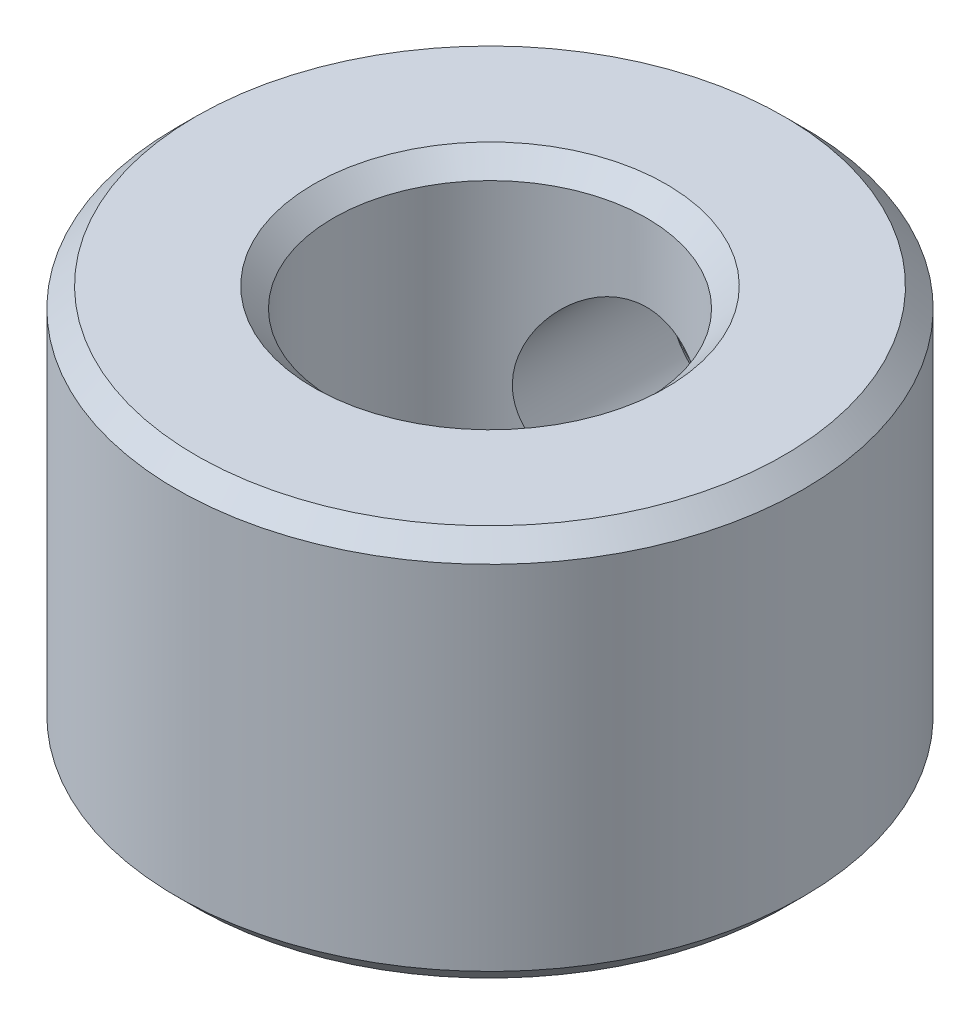
ISO-10303-21;
HEADER;
FILE_DESCRIPTION(('STEP AP214'),'2;1');
FILE_NAME('part.step','',(''),(''),'','','');
FILE_SCHEMA(('AUTOMOTIVE_DESIGN { 1 0 10303 214 1 1 1 1 }'));
ENDSEC;
DATA;
#1=APPLICATION_CONTEXT('core data for automotive mechanical design processes');
#2=APPLICATION_PROTOCOL_DEFINITION('international standard','automotive_design',2000,#1);
#3=PRODUCT_CONTEXT('',#1,'mechanical');
#4=PRODUCT('Part','Part','',(#3));
#5=PRODUCT_RELATED_PRODUCT_CATEGORY('part','',(#4));
#6=PRODUCT_DEFINITION_FORMATION('','',#4);
#7=PRODUCT_DEFINITION_CONTEXT('part definition',#1,'design');
#8=PRODUCT_DEFINITION('design','',#6,#7);
#9=PRODUCT_DEFINITION_SHAPE('','',#8);
#10=(LENGTH_UNIT() NAMED_UNIT(*) SI_UNIT(.MILLI.,.METRE.));
#11=(NAMED_UNIT(*) PLANE_ANGLE_UNIT() SI_UNIT($,.RADIAN.));
#12=(NAMED_UNIT(*) SI_UNIT($,.STERADIAN.) SOLID_ANGLE_UNIT());
#13=UNCERTAINTY_MEASURE_WITH_UNIT(LENGTH_MEASURE(1.E-05),#10,'distance_accuracy_value','');
#14=(GEOMETRIC_REPRESENTATION_CONTEXT(3) GLOBAL_UNCERTAINTY_ASSIGNED_CONTEXT((#13)) GLOBAL_UNIT_ASSIGNED_CONTEXT((#10,
#11,#12)) REPRESENTATION_CONTEXT('',''));
#15=CARTESIAN_POINT('',(0.,0.,0.));
#16=DIRECTION('',(0.,0.,1.));
#17=DIRECTION('',(1.,0.,0.));
#18=AXIS2_PLACEMENT_3D('',#15,#16,#17);
#19=CARTESIAN_POINT('',(0.,4.875,0.));
#20=DIRECTION('',(0.,1.,0.));
#21=DIRECTION('',(1.,0.,0.));
#22=AXIS2_PLACEMENT_3D('',#19,#20,#21);
#23=CONICAL_SURFACE('',#22,2.125,0.785398163397448);
#24=CARTESIAN_POINT('',(0.,5.,0.));
#25=DIRECTION('',(0.,1.,0.));
#26=DIRECTION('',(1.,0.,0.));
#27=AXIS2_PLACEMENT_3D('',#24,#25,#26);
#28=CIRCLE('',#27,2.25);
#29=CARTESIAN_POINT('',(-2.25,5.,0.));
#30=VERTEX_POINT('',#29);
#31=EDGE_CURVE('E177',#30,#30,#28,.T.);
#32=ORIENTED_EDGE('',*,*,#31,.T.);
#33=DIRECTION('',(0.707106781186547,-0.707106781186548,0.));
#34=VECTOR('',#33,1.);
#35=CARTESIAN_POINT('',(-2.125,4.875,0.));
#36=LINE('',#35,#34);
#37=CARTESIAN_POINT('',(-2.,4.75,0.));
#38=VERTEX_POINT('',#37);
#39=EDGE_CURVE('E11',#30,#38,#36,.T.);
#40=ORIENTED_EDGE('',*,*,#39,.T.);
#41=CARTESIAN_POINT('',(0.,4.75,0.));
#42=DIRECTION('',(0.,-1.,0.));
#43=DIRECTION('',(1.,0.,0.));
#44=AXIS2_PLACEMENT_3D('',#41,#42,#43);
#45=CIRCLE('',#44,2.);
#46=EDGE_CURVE('E198',#38,#38,#45,.T.);
#47=ORIENTED_EDGE('',*,*,#46,.T.);
#48=ORIENTED_EDGE('',*,*,#39,.F.);
#49=EDGE_LOOP('',(#32,#40,#47,#48));
#50=FACE_BOUND('',#49,.T.);
#51=ADVANCED_FACE('F17',(#50),#23,.F.);
#52=CARTESIAN_POINT('',(0.,0.,0.));
#53=DIRECTION('',(0.,1.,0.));
#54=DIRECTION('',(1.,0.,0.));
#55=AXIS2_PLACEMENT_3D('',#52,#53,#54);
#56=CYLINDRICAL_SURFACE('',#55,2.);
#57=CARTESIAN_POINT('',(1.2645,2.5,-1.54952888001483));
#58=CARTESIAN_POINT('',(1.26449411796691,2.43735012324644,-1.54953832528692));
#59=CARTESIAN_POINT('',(1.25980123596175,2.37460998732213,-1.55340009895582));
#60=CARTESIAN_POINT('',(1.24137298283824,2.25126618343794,-1.56815840057098));
#61=CARTESIAN_POINT('',(1.22761427551083,2.19066845550868,-1.57907308189968));
#62=CARTESIAN_POINT('',(1.19205271815077,2.07376857766439,-1.60608182446035));
#63=CARTESIAN_POINT('',(1.17032101939601,2.01743359363941,-1.62212991738661));
#64=CARTESIAN_POINT('',(1.11963684574248,1.90928453446939,-1.65751838322308));
#65=CARTESIAN_POINT('',(1.09068388775742,1.85747076209657,-1.67685897636678));
#66=CARTESIAN_POINT('',(1.02173617894958,1.75199397208212,-1.71986123397177));
#67=CARTESIAN_POINT('',(0.980769943374188,1.69905883131843,-1.7437511823403));
#68=CARTESIAN_POINT('',(0.89093919554735,1.6001925381209,-1.79131669705349));
#69=CARTESIAN_POINT('',(0.842067766194926,1.55426758868601,-1.81499205629592));
#70=CARTESIAN_POINT('',(0.730451803901077,1.465052650476,-1.86294646109463));
#71=CARTESIAN_POINT('',(0.666737528883957,1.42280305888443,-1.88693350492434));
#72=CARTESIAN_POINT('',(0.531298337879028,1.34996747456659,-1.92944044111025));
#73=CARTESIAN_POINT('',(0.459581610447951,1.31936969802778,-1.9479658526651));
#74=CARTESIAN_POINT('',(0.318000809823785,1.27412401821854,-1.97573486186531));
#75=CARTESIAN_POINT('',(0.248713007533473,1.25815324205258,-1.98574058327142));
#76=CARTESIAN_POINT('',(0.107801673786748,1.23810190006417,-1.99833990319646));
#77=CARTESIAN_POINT('',(0.0361807627911929,1.23400843009899,-2.00094154584486));
#78=CARTESIAN_POINT('',(-0.0967328525311562,1.23769823411709,-1.99861152687371));
#79=CARTESIAN_POINT('',(-0.158094030613458,1.24392864060202,-1.99466473631825));
#80=CARTESIAN_POINT('',(-0.278694570481386,1.26507623336505,-1.98141571029734));
#81=CARTESIAN_POINT('',(-0.337933771771026,1.27999407525198,-1.97211307064624));
#82=CARTESIAN_POINT('',(-0.452914762909885,1.31784031499373,-1.9489274314289));
#83=CARTESIAN_POINT('',(-0.508651031986307,1.34078100131795,-1.9350374072614));
#84=CARTESIAN_POINT('',(-0.615518921331753,1.39380889945209,-1.90374389911779));
#85=CARTESIAN_POINT('',(-0.66664952948229,1.42389767683448,-1.88633964558184));
#86=CARTESIAN_POINT('',(-0.769757581284988,1.49460510074034,-1.84685964638113));
#87=CARTESIAN_POINT('',(-0.821032566750792,1.53607218519547,-1.82447166495386));
#88=CARTESIAN_POINT('',(-0.916345547494313,1.62616876997324,-1.77851561123726));
#89=CARTESIAN_POINT('',(-0.960372651636247,1.67480884469536,-1.75494583119227));
#90=CARTESIAN_POINT('',(-1.04598643244538,1.78556668533021,-1.70548199944205));
#91=CARTESIAN_POINT('',(-1.08644277160218,1.84861743719009,-1.67970330352267));
#92=CARTESIAN_POINT('',(-1.15604990573414,1.98216587136297,-1.63258088815751));
#93=CARTESIAN_POINT('',(-1.1852213789095,2.05264962893361,-1.61122909058669));
#94=CARTESIAN_POINT('',(-1.2246161450688,2.17992201583035,-1.58137778507439));
#95=CARTESIAN_POINT('',(-1.23781972955308,2.23533731102721,-1.57096854929203));
#96=CARTESIAN_POINT('',(-1.2566505024441,2.34817824878922,-1.55594978135884));
#97=CARTESIAN_POINT('',(-1.26228851443341,2.40560089853876,-1.55133196441425));
#98=CARTESIAN_POINT('',(-1.26564578829317,2.52098806068944,-1.54859515876369));
#99=CARTESIAN_POINT('',(-1.26334448419211,2.57895359188928,-1.55049304825479));
#100=CARTESIAN_POINT('',(-1.25093577610471,2.69350884817042,-1.56051880729487));
#101=CARTESIAN_POINT('',(-1.24082186157763,2.75009738516122,-1.56865187280686));
#102=CARTESIAN_POINT('',(-1.21366943674918,2.85925861904806,-1.58974532293077));
#103=CARTESIAN_POINT('',(-1.1967843787254,2.91189147657731,-1.60259823220519));
#104=CARTESIAN_POINT('',(-1.15675412768388,3.01368807254575,-1.63172650488258));
#105=CARTESIAN_POINT('',(-1.1336067386191,3.06285058637963,-1.64800306843138));
#106=CARTESIAN_POINT('',(-1.07658218628269,3.16638258759106,-1.68592855061878));
#107=CARTESIAN_POINT('',(-1.04149675234294,3.21992850889003,-1.70800822887954));
#108=CARTESIAN_POINT('',(-0.963864401793085,3.32096981729384,-1.75299258821368));
#109=CARTESIAN_POINT('',(-0.921309629627182,3.36845874251176,-1.77589811748598));
#110=CARTESIAN_POINT('',(-0.821420704703212,3.46425733392833,-1.82451368153187));
#111=CARTESIAN_POINT('',(-0.762803985042327,3.51133859050659,-1.8500399732252));
#112=CARTESIAN_POINT('',(-0.636990044557513,3.59494194218451,-1.8970357779525));
#113=CARTESIAN_POINT('',(-0.569796236109793,3.6314682178001,-1.91850689595041));
#114=CARTESIAN_POINT('',(-0.432254308912909,3.69054688083504,-1.95394855830421));
#115=CARTESIAN_POINT('',(-0.362282006019539,3.7137564589949,-1.96826622926783));
#116=CARTESIAN_POINT('',(-0.218314556068939,3.74769609803434,-1.98937292908515));
#117=CARTESIAN_POINT('',(-0.144325456886686,3.75844440401708,-1.99617296416441));
#118=CARTESIAN_POINT('',(-0.00665707801373274,3.76606929450586,-2.00099185098277));
#119=CARTESIAN_POINT('',(0.0568858046173655,3.76480085080471,-2.0001850416096));
#120=CARTESIAN_POINT('',(0.182709540069951,3.75282403612561,-1.99263276935113));
#121=CARTESIAN_POINT('',(0.244990477096484,3.74211629713365,-1.98588770404796));
#122=CARTESIAN_POINT('',(0.364008255181647,3.712464633797,-1.96748125913666));
#123=CARTESIAN_POINT('',(0.420867567149991,3.6938735435709,-1.95603107711261));
#124=CARTESIAN_POINT('',(0.530593796569564,3.64932134254513,-1.92916148883134));
#125=CARTESIAN_POINT('',(0.58346008343398,3.62335907074123,-1.91374145733531));
#126=CARTESIAN_POINT('',(0.68954176175382,3.56189672046674,-1.8782890840866));
#127=CARTESIAN_POINT('',(0.742245311387839,3.52569494478695,-1.85794707932388));
#128=CARTESIAN_POINT('',(0.841195569530736,3.44624724224734,-1.81529603663499));
#129=CARTESIAN_POINT('',(0.887435048339554,3.40299354345176,-1.79298484104648));
#130=CARTESIAN_POINT('',(0.979270491623404,3.3032714453577,-1.7447348464483));
#131=CARTESIAN_POINT('',(1.02375166101236,3.24579451602162,-1.71874926626124));
#132=CARTESIAN_POINT('',(1.10261752614741,3.12329097722003,-1.66925222113531));
#133=CARTESIAN_POINT('',(1.1370067814702,3.05826779577634,-1.64573964197263));
#134=CARTESIAN_POINT('',(1.18818249135166,2.93651580305712,-1.60903404622307));
#135=CARTESIAN_POINT('',(1.20717019521899,2.88105495048418,-1.59470883609959));
#136=CARTESIAN_POINT('',(1.23737203476855,2.76706109813201,-1.57139495785571));
#137=CARTESIAN_POINT('',(1.24861010049216,2.70853816143648,-1.56238987421431));
#138=CARTESIAN_POINT('',(1.25859624043419,2.62456942414068,-1.55433160058593));
#139=CARTESIAN_POINT('',(1.26080597808091,2.59974838666082,-1.55253745914827));
#140=CARTESIAN_POINT('',(1.26375922886068,2.54995637712227,-1.5501340553494));
#141=CARTESIAN_POINT('',(1.26450234581071,2.52498536637754,-1.54952511315053));
#142=CARTESIAN_POINT('',(1.2645,2.5,-1.54952888001483));
#143=B_SPLINE_CURVE_WITH_KNOTS('',3,(#57,#58,#59,#60,#61,#62,#63,#64,#65,#66,#67,#68,#69,#70,
#71,#72,#73,#74,#75,#76,#77,#78,#79,#80,#81,#82,#83,#84,#85,#86,#87,#88,#89,#90,#91,#92,#93,#94,
#95,#96,#97,#98,#99,#100,#101,#102,#103,#104,#105,#106,#107,#108,#109,#110,#111,#112,#113,#114,
#115,#116,#117,#118,#119,#120,#121,#122,#123,#124,#125,#126,#127,#128,#129,#130,#131,#132,#133,
#134,#135,#136,#137,#138,#139,#140,#141,#142),.UNSPECIFIED.,.T.,.F.,(4,2,2,2,2,2,2,2,2,2,2,2,2,
2,2,2,2,2,2,2,2,2,2,2,2,2,2,2,2,2,2,2,2,2,2,2,2,2,2,2,2,2,4),(0.,0.187834998618613,
0.376155399361165,0.562834551812605,0.74952619603823,0.96192621140118,1.17451309377345,
1.41357454197133,1.65239357434149,1.86649900785851,2.08037173848349,2.26489251750059,
2.44942722342765,2.63424582532583,2.81910494351061,3.02721650045857,3.23563797985774,
3.47217432561049,3.70827516954924,3.88128567913113,4.05404840877014,4.2272589979291,
4.40061408588117,4.57024443479238,4.73993434621561,4.94234058954809,5.14496099459186,
5.38196739397222,5.618879793056,5.84278297062728,6.06635790592645,6.25605905235322,
6.44574749874689,6.62771803900912,6.80971725661148,7.01023551077349,7.21097626913794,
7.44152072744398,7.67196086369056,7.85232662520503,8.03213291238308,8.10702306777426,
8.18193345071839),.UNSPECIFIED.);
#144=CARTESIAN_POINT('',(-1.2645,2.5,-1.54952888001483));
#145=VERTEX_POINT('',#144);
#146=EDGE_CURVE('E94',#145,#145,#143,.T.);
#147=ORIENTED_EDGE('',*,*,#146,.T.);
#148=EDGE_LOOP('',(#147));
#149=FACE_BOUND('',#148,.T.);
#150=ORIENTED_EDGE('',*,*,#46,.F.);
#151=DIRECTION('',(0.,-1.,0.));
#152=VECTOR('',#151,1.);
#153=CARTESIAN_POINT('',(-2.,0.,0.));
#154=LINE('',#153,#152);
#155=CARTESIAN_POINT('',(-2.,0.25,0.));
#156=VERTEX_POINT('',#155);
#157=EDGE_CURVE('E26',#38,#156,#154,.T.);
#158=ORIENTED_EDGE('',*,*,#157,.T.);
#159=CARTESIAN_POINT('',(0.,0.25,0.));
#160=DIRECTION('',(0.,1.,0.));
#161=DIRECTION('',(1.,0.,0.));
#162=AXIS2_PLACEMENT_3D('',#159,#160,#161);
#163=CIRCLE('',#162,2.);
#164=EDGE_CURVE('E180',#156,#156,#163,.T.);
#165=ORIENTED_EDGE('',*,*,#164,.F.);
#166=ORIENTED_EDGE('',*,*,#157,.F.);
#167=EDGE_LOOP('',(#150,#158,#165,#166));
#168=FACE_BOUND('',#167,.T.);
#169=ADVANCED_FACE('F162',(#149,#168),#56,.F.);
#170=CARTESIAN_POINT('',(0.,0.125,0.));
#171=DIRECTION('',(0.,-1.,0.));
#172=DIRECTION('',(1.,0.,0.));
#173=AXIS2_PLACEMENT_3D('',#170,#171,#172);
#174=CONICAL_SURFACE('',#173,2.125,0.785398163397448);
#175=ORIENTED_EDGE('',*,*,#164,.T.);
#176=DIRECTION('',(-0.707106781186547,-0.707106781186548,0.));
#177=VECTOR('',#176,1.);
#178=CARTESIAN_POINT('',(-2.125,0.125,0.));
#179=LINE('',#178,#177);
#180=CARTESIAN_POINT('',(-2.25,0.,0.));
#181=VERTEX_POINT('',#180);
#182=EDGE_CURVE('E188',#156,#181,#179,.T.);
#183=ORIENTED_EDGE('',*,*,#182,.T.);
#184=CARTESIAN_POINT('',(0.,0.,0.));
#185=DIRECTION('',(0.,-1.,0.));
#186=DIRECTION('',(1.,0.,0.));
#187=AXIS2_PLACEMENT_3D('',#184,#185,#186);
#188=CIRCLE('',#187,2.25);
#189=EDGE_CURVE('E235',#181,#181,#188,.T.);
#190=ORIENTED_EDGE('',*,*,#189,.T.);
#191=ORIENTED_EDGE('',*,*,#182,.F.);
#192=EDGE_LOOP('',(#175,#183,#190,#191));
#193=FACE_BOUND('',#192,.T.);
#194=ADVANCED_FACE('F175',(#193),#174,.F.);
#195=CARTESIAN_POINT('',(0.,5.,0.));
#196=DIRECTION('',(0.,1.,0.));
#197=DIRECTION('',(1.,0.,0.));
#198=AXIS2_PLACEMENT_3D('',#195,#196,#197);
#199=PLANE('',#198);
#200=ORIENTED_EDGE('',*,*,#31,.F.);
#201=EDGE_LOOP('',(#200));
#202=FACE_BOUND('',#201,.T.);
#203=CARTESIAN_POINT('',(0.,5.,0.));
#204=DIRECTION('',(0.,-1.,0.));
#205=DIRECTION('',(1.,0.,0.));
#206=AXIS2_PLACEMENT_3D('',#203,#204,#205);
#207=CIRCLE('',#206,3.75);
#208=CARTESIAN_POINT('',(-3.75,5.,0.));
#209=VERTEX_POINT('',#208);
#210=EDGE_CURVE('E190',#209,#209,#207,.T.);
#211=ORIENTED_EDGE('',*,*,#210,.F.);
#212=EDGE_LOOP('',(#211));
#213=FACE_BOUND('',#212,.T.);
#214=ADVANCED_FACE('F295',(#202,#213),#199,.T.);
#215=CARTESIAN_POINT('',(0.,4.875,0.));
#216=DIRECTION('',(0.,-1.,0.));
#217=DIRECTION('',(1.,0.,0.));
#218=AXIS2_PLACEMENT_3D('',#215,#216,#217);
#219=CONICAL_SURFACE('',#218,3.875,0.785398163397448);
#220=ORIENTED_EDGE('',*,*,#210,.T.);
#221=DIRECTION('',(-0.707106781186548,-0.707106781186548,0.));
#222=VECTOR('',#221,1.);
#223=CARTESIAN_POINT('',(-3.875,4.875,0.));
#224=LINE('',#223,#222);
#225=CARTESIAN_POINT('',(-4.,4.75,0.));
#226=VERTEX_POINT('',#225);
#227=EDGE_CURVE('E181',#209,#226,#224,.T.);
#228=ORIENTED_EDGE('',*,*,#227,.T.);
#229=CARTESIAN_POINT('',(0.,4.75,0.));
#230=DIRECTION('',(0.,1.,0.));
#231=DIRECTION('',(1.,0.,0.));
#232=AXIS2_PLACEMENT_3D('',#229,#230,#231);
#233=CIRCLE('',#232,4.);
#234=EDGE_CURVE('E148',#226,#226,#233,.T.);
#235=ORIENTED_EDGE('',*,*,#234,.T.);
#236=ORIENTED_EDGE('',*,*,#227,.F.);
#237=EDGE_LOOP('',(#220,#228,#235,#236));
#238=FACE_BOUND('',#237,.T.);
#239=ADVANCED_FACE('F292',(#238),#219,.T.);
#240=CARTESIAN_POINT('',(0.,0.,0.));
#241=DIRECTION('',(0.,1.,0.));
#242=DIRECTION('',(1.,0.,0.));
#243=AXIS2_PLACEMENT_3D('',#240,#241,#242);
#244=PLANE('',#243);
#245=ORIENTED_EDGE('',*,*,#189,.F.);
#246=EDGE_LOOP('',(#245));
#247=FACE_BOUND('',#246,.T.);
#248=CARTESIAN_POINT('',(0.,0.,0.));
#249=DIRECTION('',(0.,1.,0.));
#250=DIRECTION('',(1.,0.,0.));
#251=AXIS2_PLACEMENT_3D('',#248,#249,#250);
#252=CIRCLE('',#251,3.75);
#253=CARTESIAN_POINT('',(-3.75,0.,0.));
#254=VERTEX_POINT('',#253);
#255=EDGE_CURVE('E230',#254,#254,#252,.T.);
#256=ORIENTED_EDGE('',*,*,#255,.F.);
#257=EDGE_LOOP('',(#256));
#258=FACE_BOUND('',#257,.T.);
#259=ADVANCED_FACE('F287',(#247,#258),#244,.F.);
#260=CARTESIAN_POINT('',(0.,0.125,0.));
#261=DIRECTION('',(0.,1.,0.));
#262=DIRECTION('',(1.,0.,0.));
#263=AXIS2_PLACEMENT_3D('',#260,#261,#262);
#264=CONICAL_SURFACE('',#263,3.875,0.785398163397449);
#265=CARTESIAN_POINT('',(0.,0.25,0.));
#266=DIRECTION('',(0.,-1.,0.));
#267=DIRECTION('',(1.,0.,0.));
#268=AXIS2_PLACEMENT_3D('',#265,#266,#267);
#269=CIRCLE('',#268,4.);
#270=CARTESIAN_POINT('',(-4.,0.25,0.));
#271=VERTEX_POINT('',#270);
#272=EDGE_CURVE('E231',#271,#271,#269,.T.);
#273=ORIENTED_EDGE('',*,*,#272,.T.);
#274=DIRECTION('',(0.707106781186548,-0.707106781186547,0.));
#275=VECTOR('',#274,1.);
#276=CARTESIAN_POINT('',(-3.875,0.125,0.));
#277=LINE('',#276,#275);
#278=EDGE_CURVE('E193',#271,#254,#277,.T.);
#279=ORIENTED_EDGE('',*,*,#278,.T.);
#280=ORIENTED_EDGE('',*,*,#255,.T.);
#281=ORIENTED_EDGE('',*,*,#278,.F.);
#282=EDGE_LOOP('',(#273,#279,#280,#281));
#283=FACE_BOUND('',#282,.T.);
#284=ADVANCED_FACE('F169',(#283),#264,.T.);
#285=CARTESIAN_POINT('',(0.,0.,0.));
#286=DIRECTION('',(0.,1.,0.));
#287=DIRECTION('',(1.,0.,0.));
#288=AXIS2_PLACEMENT_3D('',#285,#286,#287);
#289=CYLINDRICAL_SURFACE('',#288,4.);
#290=CARTESIAN_POINT('',(-1.49909382170273,2.5,-3.70846568188599));
#291=CARTESIAN_POINT('',(-1.49909382170273,2.72089732128893,-3.70846568188599));
#292=CARTESIAN_POINT('',(-1.38922205118641,3.19635642810341,-3.75235090255221));
#293=CARTESIAN_POINT('',(-0.83670897618908,3.89780784607125,-3.94334263837228));
#294=CARTESIAN_POINT('',(0.134475216136004,4.14246029251629,-4.05059755334012));
#295=CARTESIAN_POINT('',(0.877762587617222,3.76473716202204,-3.90863752858632));
#296=CARTESIAN_POINT('',(1.17855956450457,3.46068884661615,-3.82497921274844));
#297=CARTESIAN_POINT('',(1.42325993677328,3.06780020018476,-3.74155425360215));
#298=CARTESIAN_POINT('',(1.54874891459138,2.5047164954535,-3.68554379966131));
#299=CARTESIAN_POINT('',(1.34579703618987,1.58050804657097,-3.77692919929063));
#300=CARTESIAN_POINT('',(0.58671246259579,0.976733181262446,-4.00522023908345));
#301=CARTESIAN_POINT('',(-0.344933753518193,0.971338670866824,-4.00467209967727));
#302=CARTESIAN_POINT('',(-0.980947661805724,1.28301447876608,-3.8915658372877));
#303=CARTESIAN_POINT('',(-1.38467666273256,1.80064474179365,-3.75513782088051));
#304=CARTESIAN_POINT('',(-1.49909382170273,2.27910267871108,-3.70846568188599));
#305=CARTESIAN_POINT('',(-1.49909382170273,2.5,-3.70846568188599));
#306=(BOUNDED_CURVE() B_SPLINE_CURVE(3,(#290,#291,#292,#293,#294,#295,#296,#297,#298,#299,#300,
#301,#302,#303,#304,#305),.UNSPECIFIED.,.T.,.F.) B_SPLINE_CURVE_WITH_KNOTS((4,1,1,1,1,1,1,1,1,1,
1,1,1,4),(0.,0.0548453600584061,0.109690720116813,0.219381440233627,0.274226800292034,
0.301649480321237,0.329072160350441,0.383917520408847,0.438762880467254,0.548453600584068,
0.603298960642475,0.658144320700881,0.712989680759288,0.767835040817695),
.UNSPECIFIED.) CURVE() GEOMETRIC_REPRESENTATION_ITEM() RATIONAL_B_SPLINE_CURVE((1.,1.,1.,1.,1.,
1.,1.,1.,1.,1.,1.,1.,1.,1.,1.,1.)) REPRESENTATION_ITEM(''));
#307=CARTESIAN_POINT('',(-1.49909382170353,2.5,-3.70846568188655));
#308=VERTEX_POINT('',#307);
#309=EDGE_CURVE('E86',#308,#308,#306,.T.);
#310=ORIENTED_EDGE('',*,*,#309,.F.);
#311=EDGE_LOOP('',(#310));
#312=FACE_BOUND('',#311,.T.);
#313=ORIENTED_EDGE('',*,*,#234,.F.);
#314=DIRECTION('',(0.,-1.,0.));
#315=VECTOR('',#314,1.);
#316=CARTESIAN_POINT('',(-4.,0.,0.));
#317=LINE('',#316,#315);
#318=EDGE_CURVE('E156',#226,#271,#317,.T.);
#319=ORIENTED_EDGE('',*,*,#318,.T.);
#320=ORIENTED_EDGE('',*,*,#272,.F.);
#321=ORIENTED_EDGE('',*,*,#318,.F.);
#322=EDGE_LOOP('',(#313,#319,#320,#321));
#323=FACE_BOUND('',#322,.T.);
#324=ADVANCED_FACE('F164',(#312,#323),#289,.T.);
#325=CARTESIAN_POINT('',(0.,2.5,0.));
#326=DIRECTION('',(0.,0.,-1.));
#327=DIRECTION('',(1.,0.,0.));
#328=AXIS2_PLACEMENT_3D('',#325,#326,#327);
#329=CYLINDRICAL_SURFACE('',#328,1.2645);
#330=ORIENTED_EDGE('',*,*,#146,.F.);
#331=DIRECTION('',(0.,0.,-1.));
#332=VECTOR('',#331,1.);
#333=CARTESIAN_POINT('',(-1.2645,2.5,0.));
#334=LINE('',#333,#332);
#335=CARTESIAN_POINT('',(-1.2645,2.5,-3.54487018882069));
#336=VERTEX_POINT('',#335);
#337=EDGE_CURVE('E141',#145,#336,#334,.T.);
#338=ORIENTED_EDGE('',*,*,#337,.T.);
#339=CARTESIAN_POINT('',(-1.2645,2.5,-3.54487018882069));
#340=CARTESIAN_POINT('',(-1.2645,2.30513838343412,-3.54487018882069));
#341=CARTESIAN_POINT('',(-1.15345052099916,1.88446936891256,-3.57970347471206));
#342=CARTESIAN_POINT('',(-0.786408014453958,1.45704909304605,-3.67834808926274));
#343=CARTESIAN_POINT('',(-0.265009806986551,1.2252731657563,-3.75286596992555));
#344=CARTESIAN_POINT('',(0.447537665195123,1.22598802030911,-3.75513969316828));
#345=CARTESIAN_POINT('',(1.11012956348669,1.68773755547493,-3.5972577942593));
#346=CARTESIAN_POINT('',(1.31564721330752,2.50481059416571,-3.52710582475938));
#347=CARTESIAN_POINT('',(1.18951754981533,3.00031332352077,-3.56982230561473));
#348=CARTESIAN_POINT('',(0.966644388217517,3.33074133040212,-3.62998545166653));
#349=CARTESIAN_POINT('',(0.700913744542567,3.57814661811471,-3.68941528329172));
#350=CARTESIAN_POINT('',(0.0977762955579307,3.85760231497487,-3.78324886983267));
#351=CARTESIAN_POINT('',(-0.650957008547244,3.68817240149751,-3.71447903576025));
#352=CARTESIAN_POINT('',(-1.15935930369818,3.11493574902256,-3.57827749934624));
#353=CARTESIAN_POINT('',(-1.2645,2.69486161656589,-3.54487018882069));
#354=CARTESIAN_POINT('',(-1.2645,2.5,-3.54487018882069));
#355=(BOUNDED_CURVE() B_SPLINE_CURVE(3,(#339,#340,#341,#342,#343,#344,#345,#346,#347,#348,#349,
#350,#351,#352,#353,#354),.UNSPECIFIED.,.T.,.F.) B_SPLINE_CURVE_WITH_KNOTS((4,1,1,1,1,1,1,1,1,1,
1,1,1,4),(0.,0.0548453600584068,0.109690720116814,0.16453608017522,0.219381440233627,
0.329072160350441,0.383917520408848,0.438762880467254,0.466185560496458,0.493608240525661,
0.548453600584068,0.658144320700882,0.712989680759289,0.767835040817695),
.UNSPECIFIED.) CURVE() GEOMETRIC_REPRESENTATION_ITEM() RATIONAL_B_SPLINE_CURVE((1.,1.,1.,1.,1.,
1.,1.,1.,1.,1.,1.,1.,1.,1.,1.,1.)) REPRESENTATION_ITEM(''));
#356=EDGE_CURVE('E95',#336,#336,#355,.T.);
#357=ORIENTED_EDGE('',*,*,#356,.F.);
#358=ORIENTED_EDGE('',*,*,#337,.F.);
#359=EDGE_LOOP('',(#330,#338,#357,#358));
#360=FACE_BOUND('',#359,.T.);
#361=ADVANCED_FACE('F116',(#360),#329,.F.);
#362=CARTESIAN_POINT('',(-1.49909382170353,2.5,-3.70846568188655));
#363=CARTESIAN_POINT('',(-1.49909382170353,2.27910267871099,-3.70846568188655));
#364=CARTESIAN_POINT('',(-1.38467666273335,1.80064474179336,-3.75513782088111));
#365=CARTESIAN_POINT('',(-0.980947661806387,1.28301447876549,-3.89156583728843));
#366=CARTESIAN_POINT('',(-0.344933753518465,0.971338670865958,-4.00467209967813));
#367=CARTESIAN_POINT('',(0.586712462596265,0.976733181261597,-4.0052202390843));
#368=CARTESIAN_POINT('',(1.34579703619067,1.5805080465706,-3.77692919929124));
#369=CARTESIAN_POINT('',(1.54874891459217,2.5047164954535,-3.68554379966185));
#370=CARTESIAN_POINT('',(1.42325993677408,3.06780020018499,-3.74155425360274));
#371=CARTESIAN_POINT('',(1.17855956450529,3.46068884661659,-3.8249792127491));
#372=CARTESIAN_POINT('',(0.877762587617825,3.76473716202268,-3.90863752858707));
#373=CARTESIAN_POINT('',(0.134475216136129,4.14246029251726,-4.05059755334103));
#374=CARTESIAN_POINT('',(-0.836708976189713,3.89780784607197,-3.94334263837306));
#375=CARTESIAN_POINT('',(-1.38922205118719,3.19635642810369,-3.7523509025528));
#376=CARTESIAN_POINT('',(-1.49909382170353,2.72089732128902,-3.70846568188655));
#377=CARTESIAN_POINT('',(-1.49909382170353,2.5,-3.70846568188655));
#378=CARTESIAN_POINT('',(-1.42089588113569,2.5,-3.6539338508646));
#379=CARTESIAN_POINT('',(-1.42089588113569,2.28778124695203,-3.6539338508646));
#380=CARTESIAN_POINT('',(-1.30760128215528,1.82858628416643,-3.69665970549143));
#381=CARTESIAN_POINT('',(-0.91610111268891,1.34102601685901,-3.8204932546132));
#382=CARTESIAN_POINT('',(-0.318292438007827,1.05598350249607,-3.92073672309394));
#383=CARTESIAN_POINT('',(0.540320863462551,1.05981812761077,-3.92186005711229));
#384=CARTESIAN_POINT('',(1.26724121195601,1.61625121620538,-3.71703873094726));
#385=CARTESIAN_POINT('',(1.47104834749729,2.5047478616909,-3.63273114136103));
#386=CARTESIAN_POINT('',(1.34534580778783,3.04530457463024,-3.68431027094007));
#387=CARTESIAN_POINT('',(1.10792117240936,3.41737300787843,-3.75998129238824));
#388=CARTESIAN_POINT('',(0.818812973259405,3.70254031405335,-3.83556344682196));
#389=CARTESIAN_POINT('',(0.122242242610064,4.04750763333646,-3.96148132550491));
#390=CARTESIAN_POINT('',(-0.774791653642223,3.82792936454715,-3.86705477083546));
#391=CARTESIAN_POINT('',(-1.31260113535752,3.16921620174331,-3.69432643481728));
#392=CARTESIAN_POINT('',(-1.42089588113569,2.71221875304797,-3.6539338508646));
#393=CARTESIAN_POINT('',(-1.42089588113569,2.5,-3.6539338508646));
#394=CARTESIAN_POINT('',(-1.34269794056784,2.5,-3.59940201984265));
#395=CARTESIAN_POINT('',(-1.34269794056784,2.29645981519307,-3.59940201984265));
#396=CARTESIAN_POINT('',(-1.23052590157722,1.85652782653949,-3.63818159010174));
#397=CARTESIAN_POINT('',(-0.851254563571434,1.39903755495253,-3.74942067193797));
#398=CARTESIAN_POINT('',(-0.291651122497189,1.14062833412619,-3.83680134650975));
#399=CARTESIAN_POINT('',(0.493929264328837,1.14290307395994,-3.83849987514029));
#400=CARTESIAN_POINT('',(1.18868538772135,1.65199438584016,-3.65714826260328));
#401=CARTESIAN_POINT('',(1.39334778040241,2.50477922792831,-3.5799184830602));
#402=CARTESIAN_POINT('',(1.26743167880158,3.02280894907551,-3.6270662882774));
#403=CARTESIAN_POINT('',(1.03728278031344,3.37405716914028,-3.69498337202739));
#404=CARTESIAN_POINT('',(0.759863358900986,3.64034346608403,-3.76248936505684));
#405=CARTESIAN_POINT('',(0.110009269083997,3.95255497415567,-3.87236509766879));
#406=CARTESIAN_POINT('',(-0.712874331094734,3.75805088302233,-3.79076690329786));
#407=CARTESIAN_POINT('',(-1.23598021952785,3.14207597538294,-3.63630196708176));
#408=CARTESIAN_POINT('',(-1.34269794056784,2.70354018480693,-3.59940201984265));
#409=CARTESIAN_POINT('',(-1.34269794056784,2.5,-3.59940201984265));
#410=CARTESIAN_POINT('',(-1.2645,2.5,-3.54487018882069));
#411=CARTESIAN_POINT('',(-1.2645,2.30513838343412,-3.54487018882069));
#412=CARTESIAN_POINT('',(-1.15345052099916,1.88446936891256,-3.57970347471206));
#413=CARTESIAN_POINT('',(-0.786408014453958,1.45704909304605,-3.67834808926274));
#414=CARTESIAN_POINT('',(-0.265009806986551,1.2252731657563,-3.75286596992555));
#415=CARTESIAN_POINT('',(0.447537665195123,1.22598802030911,-3.75513969316828));
#416=CARTESIAN_POINT('',(1.11012956348669,1.68773755547493,-3.5972577942593));
#417=CARTESIAN_POINT('',(1.31564721330752,2.50481059416571,-3.52710582475938));
#418=CARTESIAN_POINT('',(1.18951754981533,3.00031332352077,-3.56982230561473));
#419=CARTESIAN_POINT('',(0.966644388217517,3.33074133040212,-3.62998545166653));
#420=CARTESIAN_POINT('',(0.700913744542567,3.57814661811471,-3.68941528329172));
#421=CARTESIAN_POINT('',(0.0977762955579307,3.85760231497487,-3.78324886983267));
#422=CARTESIAN_POINT('',(-0.650957008547244,3.68817240149751,-3.71447903576025));
#423=CARTESIAN_POINT('',(-1.15935930369818,3.11493574902256,-3.57827749934624));
#424=CARTESIAN_POINT('',(-1.2645,2.69486161656589,-3.54487018882069));
#425=CARTESIAN_POINT('',(-1.2645,2.5,-3.54487018882069));
#426=(BOUNDED_SURFACE() B_SPLINE_SURFACE(3,3,((#362,#363,#364,#365,#366,#367,#368,#369,#370,
#371,#372,#373,#374,#375,#376,#377),(#378,#379,#380,#381,#382,#383,#384,#385,#386,#387,#388,
#389,#390,#391,#392,#393),(#394,#395,#396,#397,#398,#399,#400,#401,#402,#403,#404,#405,#406,
#407,#408,#409),(#410,#411,#412,#413,#414,#415,#416,#417,#418,#419,#420,#421,#422,#423,#424,
#425)),.UNSPECIFIED.,.F.,.T.,.F.) B_SPLINE_SURFACE_WITH_KNOTS((4,4),(4,1,1,1,1,1,1,1,1,1,1,1,1,
4),(0.,1.),(0.,0.0548453600584068,0.109690720116814,0.16453608017522,0.219381440233627,
0.329072160350441,0.383917520408848,0.438762880467254,0.466185560496458,0.493608240525661,
0.548453600584068,0.658144320700882,0.712989680759289,0.767835040817695),
.UNSPECIFIED.) GEOMETRIC_REPRESENTATION_ITEM() RATIONAL_B_SPLINE_SURFACE(((1.,1.,1.,1.,1.,1.,1.,
1.,1.,1.,1.,1.,1.,1.,1.,1.),(1.,1.,1.,1.,1.,1.,1.,1.,1.,1.,1.,1.,1.,1.,1.,1.),(1.,1.,1.,1.,1.,
1.,1.,1.,1.,1.,1.,1.,1.,1.,1.,1.),(1.,1.,1.,1.,1.,1.,1.,1.,1.,1.,1.,1.,1.,1.,1.,1.))) REPRESENTATION_ITEM('') SURFACE());
#427=DIRECTION('',(0.820249360785047,0.,0.5720061067259));
#428=VECTOR('',#427,1.);
#429=CARTESIAN_POINT('',(-1.49909382170353,2.5,-3.70846568188655));
#430=LINE('',#429,#428);
#431=EDGE_CURVE('E90',#308,#336,#430,.T.);
#432=ORIENTED_EDGE('',*,*,#431,.T.);
#433=ORIENTED_EDGE('',*,*,#356,.T.);
#434=ORIENTED_EDGE('',*,*,#431,.F.);
#435=ORIENTED_EDGE('',*,*,#309,.T.);
#436=EDGE_LOOP('',(#432,#433,#434,#435));
#437=FACE_BOUND('',#436,.T.);
#438=ADVANCED_FACE('F88',(#437),#426,.T.);
#439=CLOSED_SHELL('',(#51,#169,#194,#214,#239,#259,#284,#324,#361,#438));
#440=MANIFOLD_SOLID_BREP('B1',#439);
#441=ADVANCED_BREP_SHAPE_REPRESENTATION('',(#18,#440),#14);
#442=SHAPE_DEFINITION_REPRESENTATION(#9,#441);
ENDSEC;
END-ISO-10303-21;
